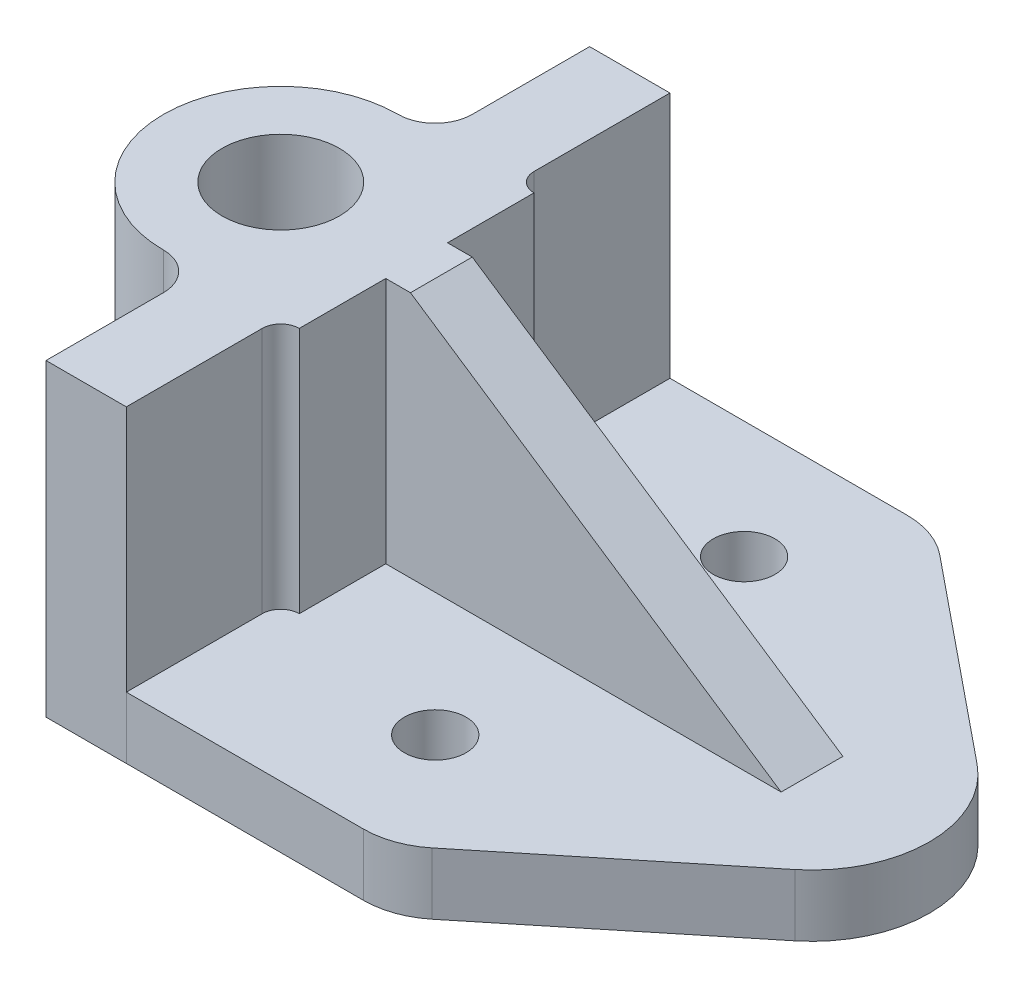
ISO-10303-21;
HEADER;
FILE_DESCRIPTION(('STEP AP214'),'2;1');
FILE_NAME('part.step','',(''),(''),'','','');
FILE_SCHEMA(('AUTOMOTIVE_DESIGN { 1 0 10303 214 1 1 1 1 }'));
ENDSEC;
DATA;
#1=APPLICATION_CONTEXT('core data for automotive mechanical design processes');
#2=APPLICATION_PROTOCOL_DEFINITION('international standard','automotive_design',2000,#1);
#3=PRODUCT_CONTEXT('',#1,'mechanical');
#4=PRODUCT('Part','Part','',(#3));
#5=PRODUCT_RELATED_PRODUCT_CATEGORY('part','',(#4));
#6=PRODUCT_DEFINITION_FORMATION('','',#4);
#7=PRODUCT_DEFINITION_CONTEXT('part definition',#1,'design');
#8=PRODUCT_DEFINITION('design','',#6,#7);
#9=PRODUCT_DEFINITION_SHAPE('','',#8);
#10=(LENGTH_UNIT() NAMED_UNIT(*) SI_UNIT(.MILLI.,.METRE.));
#11=(NAMED_UNIT(*) PLANE_ANGLE_UNIT() SI_UNIT($,.RADIAN.));
#12=(NAMED_UNIT(*) SI_UNIT($,.STERADIAN.) SOLID_ANGLE_UNIT());
#13=UNCERTAINTY_MEASURE_WITH_UNIT(LENGTH_MEASURE(1.E-05),#10,'distance_accuracy_value','');
#14=(GEOMETRIC_REPRESENTATION_CONTEXT(3) GLOBAL_UNCERTAINTY_ASSIGNED_CONTEXT((#13)) GLOBAL_UNIT_ASSIGNED_CONTEXT((#10,
#11,#12)) REPRESENTATION_CONTEXT('',''));
#15=CARTESIAN_POINT('',(0.,0.,0.));
#16=DIRECTION('',(0.,0.,1.));
#17=DIRECTION('',(1.,0.,0.));
#18=AXIS2_PLACEMENT_3D('',#15,#16,#17);
#19=CARTESIAN_POINT('',(0.,10.,0.));
#20=DIRECTION('',(0.,1.,0.));
#21=DIRECTION('',(0.,0.,1.));
#22=AXIS2_PLACEMENT_3D('',#19,#20,#21);
#23=PLANE('',#22);
#24=CARTESIAN_POINT('',(-9.19003696915669,10.,18.1944823733596));
#25=DIRECTION('',(0.,1.,0.));
#26=DIRECTION('',(0.,0.,1.));
#27=AXIS2_PLACEMENT_3D('',#24,#25,#26);
#28=CIRCLE('',#27,5.);
#29=CARTESIAN_POINT('',(-9.19003696915669,10.,23.1944823733596));
#30=VERTEX_POINT('',#29);
#31=EDGE_CURVE('E384',#30,#30,#28,.T.);
#32=ORIENTED_EDGE('',*,*,#31,.F.);
#33=EDGE_LOOP('',(#32));
#34=FACE_BOUND('',#33,.T.);
#35=CARTESIAN_POINT('',(-9.19003696915669,10.,-31.8055176266404));
#36=DIRECTION('',(0.,1.,0.));
#37=DIRECTION('',(0.,0.,-1.));
#38=AXIS2_PLACEMENT_3D('',#35,#36,#37);
#39=CIRCLE('',#38,5.);
#40=CARTESIAN_POINT('',(-9.19003696915669,10.,-36.8055176266405));
#41=VERTEX_POINT('',#40);
#42=EDGE_CURVE('E378',#41,#41,#39,.T.);
#43=ORIENTED_EDGE('',*,*,#42,.F.);
#44=EDGE_LOOP('',(#43));
#45=FACE_BOUND('',#44,.T.);
#46=DIRECTION('',(0.775816310170432,0.,0.630958836116538));
#47=VECTOR('',#46,1.);
#48=CARTESIAN_POINT('',(25.9883869742139,10.,-31.9548809455012));
#49=LINE('',#48,#47);
#50=CARTESIAN_POINT('',(6.39344516969075,10.,-47.8911296588561));
#51=VERTEX_POINT('',#50);
#52=CARTESIAN_POINT('',(38.7937423474742,10.,-21.5404928790838));
#53=VERTEX_POINT('',#52);
#54=EDGE_CURVE('E232',#51,#53,#49,.T.);
#55=ORIENTED_EDGE('',*,*,#54,.F.);
#56=CARTESIAN_POINT('',(-1.80901969982424,10.,-37.8055176266404));
#57=DIRECTION('',(0.,1.,0.));
#58=DIRECTION('',(0.,0.,1.));
#59=AXIS2_PLACEMENT_3D('',#56,#57,#58);
#60=CIRCLE('',#59,13.);
#61=CARTESIAN_POINT('',(-1.80901969982424,10.,-50.8055176266404));
#62=VERTEX_POINT('',#61);
#63=EDGE_CURVE('E63',#51,#62,#60,.T.);
#64=ORIENTED_EDGE('',*,*,#63,.T.);
#65=DIRECTION('',(-1.,0.,0.));
#66=VECTOR('',#65,1.);
#67=CARTESIAN_POINT('',(-53.1900369691567,10.,-50.8055176266404));
#68=LINE('',#67,#66);
#69=CARTESIAN_POINT('',(-53.1900369691567,10.,-50.8055176266404));
#70=VERTEX_POINT('',#69);
#71=EDGE_CURVE('E390',#62,#70,#68,.T.);
#72=ORIENTED_EDGE('',*,*,#71,.T.);
#73=DIRECTION('',(0.,0.,1.));
#74=VECTOR('',#73,1.);
#75=CARTESIAN_POINT('',(-53.1900369691567,10.,-50.8055176266404));
#76=LINE('',#75,#74);
#77=CARTESIAN_POINT('',(-53.1900369691567,10.,-50.7963341859875));
#78=VERTEX_POINT('',#77);
#79=EDGE_CURVE('E394',#70,#78,#76,.T.);
#80=ORIENTED_EDGE('',*,*,#79,.T.);
#81=DIRECTION('',(1.,0.,0.));
#82=VECTOR('',#81,1.);
#83=CARTESIAN_POINT('',(0.,10.,-50.7963341859875));
#84=LINE('',#83,#82);
#85=CARTESIAN_POINT('',(-40.1900369691567,10.,-50.7963341859875));
#86=VERTEX_POINT('',#85);
#87=EDGE_CURVE('E363',#78,#86,#84,.T.);
#88=ORIENTED_EDGE('',*,*,#87,.T.);
#89=DIRECTION('',(0.,0.,1.));
#90=VECTOR('',#89,1.);
#91=CARTESIAN_POINT('',(-40.1900369691567,10.,0.));
#92=LINE('',#91,#90);
#93=CARTESIAN_POINT('',(-40.1900369691567,10.,-28.7963341859874));
#94=VERTEX_POINT('',#93);
#95=EDGE_CURVE('E375',#86,#94,#92,.T.);
#96=ORIENTED_EDGE('',*,*,#95,.T.);
#97=CARTESIAN_POINT('',(-37.1900369691567,10.,-28.7963341859874));
#98=DIRECTION('',(0.,1.,0.));
#99=DIRECTION('',(0.,0.,1.));
#100=AXIS2_PLACEMENT_3D('',#97,#98,#99);
#101=CIRCLE('',#100,3.);
#102=CARTESIAN_POINT('',(-37.1900369691567,10.,-25.7963341859875));
#103=VERTEX_POINT('',#102);
#104=EDGE_CURVE('E372',#94,#103,#101,.T.);
#105=ORIENTED_EDGE('',*,*,#104,.T.);
#106=DIRECTION('',(0.,0.,1.));
#107=VECTOR('',#106,1.);
#108=CARTESIAN_POINT('',(-37.1900369691567,10.,0.));
#109=LINE('',#108,#107);
#110=CARTESIAN_POINT('',(-37.1900369691567,10.,-11.7963341859875));
#111=VERTEX_POINT('',#110);
#112=EDGE_CURVE('E370',#103,#111,#109,.T.);
#113=ORIENTED_EDGE('',*,*,#112,.T.);
#114=DIRECTION('',(1.,0.,0.));
#115=VECTOR('',#114,1.);
#116=CARTESIAN_POINT('',(0.,10.,-11.7963341859875));
#117=LINE('',#116,#115);
#118=CARTESIAN_POINT('',(26.8099630308433,10.,-11.7963341859875));
#119=VERTEX_POINT('',#118);
#120=EDGE_CURVE('E373',#111,#119,#117,.T.);
#121=ORIENTED_EDGE('',*,*,#120,.T.);
#122=DIRECTION('',(0.,0.,1.));
#123=VECTOR('',#122,1.);
#124=CARTESIAN_POINT('',(26.8099630308433,10.,-11.7963341859875));
#125=LINE('',#124,#123);
#126=CARTESIAN_POINT('',(26.8099630308433,10.,-1.79633418598746));
#127=VERTEX_POINT('',#126);
#128=EDGE_CURVE('E250',#119,#127,#125,.T.);
#129=ORIENTED_EDGE('',*,*,#128,.T.);
#130=DIRECTION('',(-1.,0.,0.));
#131=VECTOR('',#130,1.);
#132=CARTESIAN_POINT('',(0.,10.,-1.79633418598746));
#133=LINE('',#132,#131);
#134=CARTESIAN_POINT('',(-37.1900369691567,10.,-1.79633418598746));
#135=VERTEX_POINT('',#134);
#136=EDGE_CURVE('E369',#127,#135,#133,.T.);
#137=ORIENTED_EDGE('',*,*,#136,.T.);
#138=DIRECTION('',(0.,0.,1.));
#139=VECTOR('',#138,1.);
#140=CARTESIAN_POINT('',(-37.1900369691567,10.,0.));
#141=LINE('',#140,#139);
#142=CARTESIAN_POINT('',(-37.1900369691567,10.,12.2036658140125));
#143=VERTEX_POINT('',#142);
#144=EDGE_CURVE('E367',#135,#143,#141,.T.);
#145=ORIENTED_EDGE('',*,*,#144,.T.);
#146=CARTESIAN_POINT('',(-37.1900369691567,10.,15.2036658140125));
#147=DIRECTION('',(0.,1.,0.));
#148=DIRECTION('',(0.,0.,1.));
#149=AXIS2_PLACEMENT_3D('',#146,#147,#148);
#150=CIRCLE('',#149,3.);
#151=CARTESIAN_POINT('',(-40.1900369691567,10.,15.2036658140125));
#152=VERTEX_POINT('',#151);
#153=EDGE_CURVE('E365',#143,#152,#150,.T.);
#154=ORIENTED_EDGE('',*,*,#153,.T.);
#155=DIRECTION('',(0.,0.,1.));
#156=VECTOR('',#155,1.);
#157=CARTESIAN_POINT('',(-40.1900369691567,10.,0.));
#158=LINE('',#157,#156);
#159=CARTESIAN_POINT('',(-40.1900369691567,10.,37.1944823733596));
#160=VERTEX_POINT('',#159);
#161=EDGE_CURVE('E358',#152,#160,#158,.T.);
#162=ORIENTED_EDGE('',*,*,#161,.T.);
#163=DIRECTION('',(1.,0.,0.));
#164=VECTOR('',#163,1.);
#165=CARTESIAN_POINT('',(-53.1900369691567,10.,37.1944823733596));
#166=LINE('',#165,#164);
#167=CARTESIAN_POINT('',(-1.80679394493806,10.,37.1944823733596));
#168=VERTEX_POINT('',#167);
#169=EDGE_CURVE('E396',#160,#168,#166,.T.);
#170=ORIENTED_EDGE('',*,*,#169,.T.);
#171=CARTESIAN_POINT('',(-1.80679394493806,10.,24.1944823733596));
#172=DIRECTION('',(0.,1.,0.));
#173=DIRECTION('',(0.,0.,1.));
#174=AXIS2_PLACEMENT_3D('',#171,#172,#173);
#175=CIRCLE('',#174,13.);
#176=CARTESIAN_POINT('',(6.39260394118663,10.,34.2825879589001));
#177=VERTEX_POINT('',#176);
#178=EDGE_CURVE('E528',#168,#177,#175,.T.);
#179=ORIENTED_EDGE('',*,*,#178,.T.);
#180=DIRECTION('',(0.776008121964656,0.,-0.630722914317284));
#181=VECTOR('',#180,1.);
#182=CARTESIAN_POINT('',(19.3225298082994,10.,23.7734189257656));
#183=LINE('',#182,#181);
#184=CARTESIAN_POINT('',(38.7937423474742,10.,7.94763106299511));
#185=VERTEX_POINT('',#184);
#186=EDGE_CURVE('E222',#177,#185,#183,.T.);
#187=ORIENTED_EDGE('',*,*,#186,.T.);
#188=CARTESIAN_POINT('',(26.8100820325476,10.,-6.79643090804433));
#189=DIRECTION('',(0.,1.,0.));
#190=DIRECTION('',(0.,0.,1.));
#191=AXIS2_PLACEMENT_3D('',#188,#189,#190);
#192=CIRCLE('',#191,18.9998809982957);
#193=EDGE_CURVE('E237',#185,#53,#192,.T.);
#194=ORIENTED_EDGE('',*,*,#193,.T.);
#195=EDGE_LOOP('',(#55,#64,#72,#80,#88,#96,#105,#113,#121,#129,#137,#145,#154,#162,#170,#179,
#187,#194));
#196=FACE_BOUND('',#195,.T.);
#197=ADVANCED_FACE('F41',(#34,#45,#196),#23,.T.);
#198=CARTESIAN_POINT('',(0.,0.,0.));
#199=DIRECTION('',(0.,1.,0.));
#200=DIRECTION('',(0.,0.,1.));
#201=AXIS2_PLACEMENT_3D('',#198,#199,#200);
#202=PLANE('',#201);
#203=CARTESIAN_POINT('',(-9.19003696915669,0.,18.1944823733596));
#204=DIRECTION('',(0.,1.,0.));
#205=DIRECTION('',(0.,0.,1.));
#206=AXIS2_PLACEMENT_3D('',#203,#204,#205);
#207=CIRCLE('',#206,5.);
#208=CARTESIAN_POINT('',(-9.19003696915669,0.,23.1944823733596));
#209=VERTEX_POINT('',#208);
#210=EDGE_CURVE('E381',#209,#209,#207,.T.);
#211=ORIENTED_EDGE('',*,*,#210,.T.);
#212=EDGE_LOOP('',(#211));
#213=FACE_BOUND('',#212,.T.);
#214=CARTESIAN_POINT('',(-9.19003696915669,0.,-31.8055176266404));
#215=DIRECTION('',(0.,1.,0.));
#216=DIRECTION('',(0.,0.,-1.));
#217=AXIS2_PLACEMENT_3D('',#214,#215,#216);
#218=CIRCLE('',#217,5.);
#219=CARTESIAN_POINT('',(-9.19003696915669,0.,-36.8055176266405));
#220=VERTEX_POINT('',#219);
#221=EDGE_CURVE('E377',#220,#220,#218,.T.);
#222=ORIENTED_EDGE('',*,*,#221,.T.);
#223=EDGE_LOOP('',(#222));
#224=FACE_BOUND('',#223,.T.);
#225=DIRECTION('',(0.,0.,1.));
#226=VECTOR('',#225,1.);
#227=CARTESIAN_POINT('',(-53.1900369691567,0.,-50.8055176266404));
#228=LINE('',#227,#226);
#229=CARTESIAN_POINT('',(-53.1900369691567,0.,-14.1617941173156));
#230=VERTEX_POINT('',#229);
#231=CARTESIAN_POINT('',(-53.1900369691567,0.,0.569125745340668));
#232=VERTEX_POINT('',#231);
#233=EDGE_CURVE('E413',#230,#232,#228,.T.);
#234=ORIENTED_EDGE('',*,*,#233,.F.);
#235=CARTESIAN_POINT('',(-59.1900369691567,0.,-6.79633418598746));
#236=DIRECTION('',(0.,1.,0.));
#237=DIRECTION('',(0.,0.,1.));
#238=AXIS2_PLACEMENT_3D('',#235,#236,#237);
#239=CIRCLE('',#238,9.5);
#240=EDGE_CURVE('E271',#230,#232,#239,.T.);
#241=ORIENTED_EDGE('',*,*,#240,.T.);
#242=EDGE_LOOP('',(#234,#241));
#243=FACE_BOUND('',#242,.T.);
#244=DIRECTION('',(-1.,0.,0.));
#245=VECTOR('',#244,1.);
#246=CARTESIAN_POINT('',(-53.1900369691567,0.,-50.8055176266404));
#247=LINE('',#246,#245);
#248=CARTESIAN_POINT('',(-1.80901969982424,0.,-50.8055176266404));
#249=VERTEX_POINT('',#248);
#250=CARTESIAN_POINT('',(-53.1900369691567,0.,-50.8055176266404));
#251=VERTEX_POINT('',#250);
#252=EDGE_CURVE('E387',#249,#251,#247,.T.);
#253=ORIENTED_EDGE('',*,*,#252,.F.);
#254=CARTESIAN_POINT('',(-1.80901969982424,0.,-37.8055176266404));
#255=DIRECTION('',(0.,1.,0.));
#256=DIRECTION('',(0.,0.,1.));
#257=AXIS2_PLACEMENT_3D('',#254,#255,#256);
#258=CIRCLE('',#257,13.);
#259=CARTESIAN_POINT('',(6.39344516969075,0.,-47.8911296588561));
#260=VERTEX_POINT('',#259);
#261=EDGE_CURVE('E12',#249,#260,#258,.F.);
#262=ORIENTED_EDGE('',*,*,#261,.T.);
#263=DIRECTION('',(0.775816310170432,0.,0.630958836116538));
#264=VECTOR('',#263,1.);
#265=CARTESIAN_POINT('',(25.9883869742139,0.,-31.9548809455012));
#266=LINE('',#265,#264);
#267=CARTESIAN_POINT('',(38.7937423474742,0.,-21.5404928790838));
#268=VERTEX_POINT('',#267);
#269=EDGE_CURVE('E228',#260,#268,#266,.T.);
#270=ORIENTED_EDGE('',*,*,#269,.T.);
#271=CARTESIAN_POINT('',(26.8100820325476,0.,-6.79643090804433));
#272=DIRECTION('',(0.,1.,0.));
#273=DIRECTION('',(0.,0.,1.));
#274=AXIS2_PLACEMENT_3D('',#271,#272,#273);
#275=CIRCLE('',#274,18.9998809982957);
#276=CARTESIAN_POINT('',(38.7937423474742,0.,7.94763106299511));
#277=VERTEX_POINT('',#276);
#278=EDGE_CURVE('E225',#277,#268,#275,.T.);
#279=ORIENTED_EDGE('',*,*,#278,.F.);
#280=DIRECTION('',(0.776008121964656,0.,-0.630722914317284));
#281=VECTOR('',#280,1.);
#282=CARTESIAN_POINT('',(19.3225298082994,0.,23.7734189257656));
#283=LINE('',#282,#281);
#284=CARTESIAN_POINT('',(6.39260394118663,0.,34.2825879589001));
#285=VERTEX_POINT('',#284);
#286=EDGE_CURVE('E212',#285,#277,#283,.T.);
#287=ORIENTED_EDGE('',*,*,#286,.F.);
#288=CARTESIAN_POINT('',(-1.80679394493806,0.,24.1944823733596));
#289=DIRECTION('',(0.,1.,0.));
#290=DIRECTION('',(0.,0.,1.));
#291=AXIS2_PLACEMENT_3D('',#288,#289,#290);
#292=CIRCLE('',#291,13.);
#293=CARTESIAN_POINT('',(-1.80679394493806,0.,37.1944823733596));
#294=VERTEX_POINT('',#293);
#295=EDGE_CURVE('E543',#285,#294,#292,.F.);
#296=ORIENTED_EDGE('',*,*,#295,.T.);
#297=DIRECTION('',(1.,0.,0.));
#298=VECTOR('',#297,1.);
#299=CARTESIAN_POINT('',(-53.1900369691567,0.,37.1944823733596));
#300=LINE('',#299,#298);
#301=CARTESIAN_POINT('',(-40.1900369691567,0.,37.1944823733596));
#302=VERTEX_POINT('',#301);
#303=EDGE_CURVE('E393',#302,#294,#300,.T.);
#304=ORIENTED_EDGE('',*,*,#303,.F.);
#305=DIRECTION('',(0.,0.,-1.));
#306=VECTOR('',#305,1.);
#307=CARTESIAN_POINT('',(-40.1900369691567,0.,37.2036658140125));
#308=LINE('',#307,#306);
#309=CARTESIAN_POINT('',(-40.1900369691567,0.,37.2036658140125));
#310=VERTEX_POINT('',#309);
#311=EDGE_CURVE('E434',#310,#302,#308,.T.);
#312=ORIENTED_EDGE('',*,*,#311,.F.);
#313=DIRECTION('',(1.,0.,0.));
#314=VECTOR('',#313,1.);
#315=CARTESIAN_POINT('',(-53.1900369691567,0.,37.2036658140125));
#316=LINE('',#315,#314);
#317=CARTESIAN_POINT('',(-53.1900369691567,0.,37.2036658140125));
#318=VERTEX_POINT('',#317);
#319=EDGE_CURVE('E429',#318,#310,#316,.T.);
#320=ORIENTED_EDGE('',*,*,#319,.F.);
#321=CARTESIAN_POINT('',(-53.1900369691567,0.,18.2036658140125));
#322=VERTEX_POINT('',#321);
#323=EDGE_CURVE('E401',#322,#318,#228,.T.);
#324=ORIENTED_EDGE('',*,*,#323,.F.);
#325=CARTESIAN_POINT('',(-59.1900369691567,0.,18.2036658140125));
#326=DIRECTION('',(0.,-1.,0.));
#327=DIRECTION('',(0.,0.,1.));
#328=AXIS2_PLACEMENT_3D('',#325,#326,#327);
#329=CIRCLE('',#328,6.);
#330=CARTESIAN_POINT('',(-59.1900369691567,0.,12.2036658140125));
#331=VERTEX_POINT('',#330);
#332=EDGE_CURVE('E345',#331,#322,#329,.T.);
#333=ORIENTED_EDGE('',*,*,#332,.F.);
#334=CARTESIAN_POINT('',(-59.1900369691567,0.,-6.79633418598746));
#335=DIRECTION('',(0.,1.,0.));
#336=DIRECTION('',(0.,0.,1.));
#337=AXIS2_PLACEMENT_3D('',#334,#335,#336);
#338=CIRCLE('',#337,19.);
#339=CARTESIAN_POINT('',(-59.1900369691567,0.,-25.7963341859874));
#340=VERTEX_POINT('',#339);
#341=EDGE_CURVE('E354',#340,#331,#338,.T.);
#342=ORIENTED_EDGE('',*,*,#341,.F.);
#343=CARTESIAN_POINT('',(-59.1900369691567,0.,-31.7963341859875));
#344=DIRECTION('',(0.,-1.,0.));
#345=DIRECTION('',(0.,0.,-1.));
#346=AXIS2_PLACEMENT_3D('',#343,#344,#345);
#347=CIRCLE('',#346,6.);
#348=CARTESIAN_POINT('',(-53.1900369691567,0.,-31.7963341859875));
#349=VERTEX_POINT('',#348);
#350=EDGE_CURVE('E487',#349,#340,#347,.T.);
#351=ORIENTED_EDGE('',*,*,#350,.F.);
#352=EDGE_CURVE('E411',#251,#349,#228,.T.);
#353=ORIENTED_EDGE('',*,*,#352,.F.);
#354=EDGE_LOOP('',(#253,#262,#270,#279,#287,#296,#304,#312,#320,#324,#333,#342,#351,#353));
#355=FACE_BOUND('',#354,.T.);
#356=ADVANCED_FACE('F226',(#213,#224,#243,#355),#202,.F.);
#357=CARTESIAN_POINT('',(-53.1900369691567,10.,37.1944823733596));
#358=DIRECTION('',(0.,0.,-1.));
#359=DIRECTION('',(-1.,0.,0.));
#360=AXIS2_PLACEMENT_3D('',#357,#358,#359);
#361=PLANE('',#360);
#362=ORIENTED_EDGE('',*,*,#303,.T.);
#363=DIRECTION('',(0.,1.,0.));
#364=VECTOR('',#363,1.);
#365=CARTESIAN_POINT('',(-1.80679394493806,10.,37.1944823733596));
#366=LINE('',#365,#364);
#367=EDGE_CURVE('E524',#294,#168,#366,.T.);
#368=ORIENTED_EDGE('',*,*,#367,.T.);
#369=ORIENTED_EDGE('',*,*,#169,.F.);
#370=DIRECTION('',(0.,1.,0.));
#371=VECTOR('',#370,1.);
#372=CARTESIAN_POINT('',(-40.1900369691567,10.,37.1944823733596));
#373=LINE('',#372,#371);
#374=EDGE_CURVE('E414',#302,#160,#373,.T.);
#375=ORIENTED_EDGE('',*,*,#374,.F.);
#376=EDGE_LOOP('',(#362,#368,#369,#375));
#377=FACE_BOUND('',#376,.T.);
#378=ADVANCED_FACE('F558',(#377),#361,.F.);
#379=CARTESIAN_POINT('',(-59.1900369691567,10.,-6.79633418598746));
#380=DIRECTION('',(0.,1.,0.));
#381=DIRECTION('',(0.,0.,1.));
#382=AXIS2_PLACEMENT_3D('',#379,#380,#381);
#383=CIRCLE('',#382,9.5);
#384=CARTESIAN_POINT('',(-53.1900369691567,10.,-14.1617941173156));
#385=VERTEX_POINT('',#384);
#386=CARTESIAN_POINT('',(-53.1900369691567,10.,0.569125745340668));
#387=VERTEX_POINT('',#386);
#388=EDGE_CURVE('E360',#385,#387,#383,.F.);
#389=ORIENTED_EDGE('',*,*,#388,.F.);
#390=EDGE_CURVE('E392',#385,#387,#76,.T.);
#391=ORIENTED_EDGE('',*,*,#390,.T.);
#392=EDGE_LOOP('',(#389,#391));
#393=FACE_BOUND('',#392,.T.);
#394=ADVANCED_FACE('F571',(#393),#23,.T.);
#395=CARTESIAN_POINT('',(-53.1900369691567,10.,-50.8055176266404));
#396=DIRECTION('',(1.,0.,0.));
#397=DIRECTION('',(0.,0.,-1.));
#398=AXIS2_PLACEMENT_3D('',#395,#396,#397);
#399=PLANE('',#398);
#400=ORIENTED_EDGE('',*,*,#352,.T.);
#401=DIRECTION('',(0.,-1.,0.));
#402=VECTOR('',#401,1.);
#403=CARTESIAN_POINT('',(-53.1900369691567,10.,-31.7963341859875));
#404=LINE('',#403,#402);
#405=CARTESIAN_POINT('',(-53.1900369691567,50.,-31.7963341859875));
#406=VERTEX_POINT('',#405);
#407=EDGE_CURVE('E522',#406,#349,#404,.T.);
#408=ORIENTED_EDGE('',*,*,#407,.F.);
#409=DIRECTION('',(0.,0.,1.));
#410=VECTOR('',#409,1.);
#411=CARTESIAN_POINT('',(-53.1900369691567,50.,-31.7963341859875));
#412=LINE('',#411,#410);
#413=CARTESIAN_POINT('',(-53.1900369691567,50.,-50.7963341859875));
#414=VERTEX_POINT('',#413);
#415=EDGE_CURVE('E327',#414,#406,#412,.T.);
#416=ORIENTED_EDGE('',*,*,#415,.F.);
#417=DIRECTION('',(0.,-1.,0.));
#418=VECTOR('',#417,1.);
#419=CARTESIAN_POINT('',(-53.1900369691567,10.,-50.7963341859875));
#420=LINE('',#419,#418);
#421=EDGE_CURVE('E482',#414,#78,#420,.T.);
#422=ORIENTED_EDGE('',*,*,#421,.T.);
#423=ORIENTED_EDGE('',*,*,#79,.F.);
#424=DIRECTION('',(0.,-1.,0.));
#425=VECTOR('',#424,1.);
#426=CARTESIAN_POINT('',(-53.1900369691567,10.,-50.8055176266404));
#427=LINE('',#426,#425);
#428=EDGE_CURVE('E399',#70,#251,#427,.T.);
#429=ORIENTED_EDGE('',*,*,#428,.T.);
#430=EDGE_LOOP('',(#400,#408,#416,#422,#423,#429));
#431=FACE_BOUND('',#430,.T.);
#432=ADVANCED_FACE('F520',(#431),#399,.F.);
#433=DIRECTION('',(0.,0.,1.));
#434=VECTOR('',#433,1.);
#435=CARTESIAN_POINT('',(-53.1900369691567,50.,18.2036658140125));
#436=LINE('',#435,#434);
#437=CARTESIAN_POINT('',(-53.1900369691567,50.,18.2036658140125));
#438=VERTEX_POINT('',#437);
#439=CARTESIAN_POINT('',(-53.1900369691567,50.,37.2036658140125));
#440=VERTEX_POINT('',#439);
#441=EDGE_CURVE('E268',#438,#440,#436,.T.);
#442=ORIENTED_EDGE('',*,*,#441,.F.);
#443=DIRECTION('',(0.,-1.,0.));
#444=VECTOR('',#443,1.);
#445=CARTESIAN_POINT('',(-53.1900369691567,10.,18.2036658140125));
#446=LINE('',#445,#444);
#447=EDGE_CURVE('E351',#438,#322,#446,.T.);
#448=ORIENTED_EDGE('',*,*,#447,.T.);
#449=ORIENTED_EDGE('',*,*,#323,.T.);
#450=DIRECTION('',(0.,-1.,0.));
#451=VECTOR('',#450,1.);
#452=CARTESIAN_POINT('',(-53.1900369691567,10.,37.2036658140125));
#453=LINE('',#452,#451);
#454=EDGE_CURVE('E348',#440,#318,#453,.T.);
#455=ORIENTED_EDGE('',*,*,#454,.F.);
#456=EDGE_LOOP('',(#442,#448,#449,#455));
#457=FACE_BOUND('',#456,.T.);
#458=ADVANCED_FACE('F422',(#457),#399,.F.);
#459=CARTESIAN_POINT('',(-53.1900369691567,10.,-50.8055176266404));
#460=DIRECTION('',(0.,0.,1.));
#461=DIRECTION('',(1.,0.,0.));
#462=AXIS2_PLACEMENT_3D('',#459,#460,#461);
#463=PLANE('',#462);
#464=ORIENTED_EDGE('',*,*,#71,.F.);
#465=DIRECTION('',(0.,1.,0.));
#466=VECTOR('',#465,1.);
#467=CARTESIAN_POINT('',(-1.80901969982424,10.,-50.8055176266404));
#468=LINE('',#467,#466);
#469=EDGE_CURVE('E49',#62,#249,#468,.F.);
#470=ORIENTED_EDGE('',*,*,#469,.T.);
#471=ORIENTED_EDGE('',*,*,#252,.T.);
#472=ORIENTED_EDGE('',*,*,#428,.F.);
#473=EDGE_LOOP('',(#464,#470,#471,#472));
#474=FACE_BOUND('',#473,.T.);
#475=ADVANCED_FACE('F626',(#474),#463,.F.);
#476=ORIENTED_EDGE('',*,*,#233,.T.);
#477=DIRECTION('',(0.,-1.,0.));
#478=VECTOR('',#477,1.);
#479=CARTESIAN_POINT('',(-53.1900369691567,10.,0.56912574534067));
#480=LINE('',#479,#478);
#481=EDGE_CURVE('E525',#232,#387,#480,.F.);
#482=ORIENTED_EDGE('',*,*,#481,.T.);
#483=ORIENTED_EDGE('',*,*,#390,.F.);
#484=DIRECTION('',(0.,-1.,0.));
#485=VECTOR('',#484,1.);
#486=CARTESIAN_POINT('',(-53.1900369691567,10.,-14.1617941173156));
#487=LINE('',#486,#485);
#488=EDGE_CURVE('E530',#385,#230,#487,.T.);
#489=ORIENTED_EDGE('',*,*,#488,.T.);
#490=EDGE_LOOP('',(#476,#482,#483,#489));
#491=FACE_BOUND('',#490,.T.);
#492=ADVANCED_FACE('F587',(#491),#399,.F.);
#493=CARTESIAN_POINT('',(-9.19003696915669,10.,18.1944823733596));
#494=DIRECTION('',(0.,-1.,0.));
#495=DIRECTION('',(0.,0.,-1.));
#496=AXIS2_PLACEMENT_3D('',#493,#494,#495);
#497=CYLINDRICAL_SURFACE('',#496,5.);
#498=ORIENTED_EDGE('',*,*,#31,.T.);
#499=EDGE_LOOP('',(#498));
#500=FACE_BOUND('',#499,.T.);
#501=ORIENTED_EDGE('',*,*,#210,.F.);
#502=EDGE_LOOP('',(#501));
#503=FACE_BOUND('',#502,.T.);
#504=ADVANCED_FACE('F605',(#500,#503),#497,.F.);
#505=CARTESIAN_POINT('',(-9.19003696915669,10.,-31.8055176266404));
#506=DIRECTION('',(0.,-1.,0.));
#507=DIRECTION('',(0.,0.,-1.));
#508=AXIS2_PLACEMENT_3D('',#505,#506,#507);
#509=CYLINDRICAL_SURFACE('',#508,5.);
#510=ORIENTED_EDGE('',*,*,#42,.T.);
#511=EDGE_LOOP('',(#510));
#512=FACE_BOUND('',#511,.T.);
#513=ORIENTED_EDGE('',*,*,#221,.F.);
#514=EDGE_LOOP('',(#513));
#515=FACE_BOUND('',#514,.T.);
#516=ADVANCED_FACE('F597',(#512,#515),#509,.F.);
#517=CARTESIAN_POINT('',(-59.1900369691567,10.,-6.79633418598746));
#518=DIRECTION('',(0.,-1.,0.));
#519=DIRECTION('',(0.,0.,-1.));
#520=AXIS2_PLACEMENT_3D('',#517,#518,#519);
#521=CYLINDRICAL_SURFACE('',#520,9.5);
#522=CARTESIAN_POINT('',(-59.1900369691567,50.,-6.79633418598746));
#523=DIRECTION('',(0.,1.,0.));
#524=DIRECTION('',(0.,0.,1.));
#525=AXIS2_PLACEMENT_3D('',#522,#523,#524);
#526=CIRCLE('',#525,9.5);
#527=CARTESIAN_POINT('',(-59.1900369691567,50.,2.70366581401254));
#528=VERTEX_POINT('',#527);
#529=EDGE_CURVE('E249',#528,#528,#526,.T.);
#530=ORIENTED_EDGE('',*,*,#529,.T.);
#531=EDGE_LOOP('',(#530));
#532=FACE_BOUND('',#531,.T.);
#533=ORIENTED_EDGE('',*,*,#481,.F.);
#534=ORIENTED_EDGE('',*,*,#240,.F.);
#535=ORIENTED_EDGE('',*,*,#488,.F.);
#536=ORIENTED_EDGE('',*,*,#388,.T.);
#537=EDGE_LOOP('',(#533,#534,#535,#536));
#538=FACE_BOUND('',#537,.T.);
#539=ADVANCED_FACE('F594',(#532,#538),#521,.F.);
#540=CARTESIAN_POINT('',(-59.1900369691567,10.,18.2036658140125));
#541=DIRECTION('',(0.,-1.,0.));
#542=DIRECTION('',(0.,0.,-1.));
#543=AXIS2_PLACEMENT_3D('',#540,#541,#542);
#544=CYLINDRICAL_SURFACE('',#543,6.);
#545=ORIENTED_EDGE('',*,*,#332,.T.);
#546=ORIENTED_EDGE('',*,*,#447,.F.);
#547=CARTESIAN_POINT('',(-59.1900369691567,50.,18.2036658140125));
#548=DIRECTION('',(0.,-1.,0.));
#549=DIRECTION('',(0.,0.,1.));
#550=AXIS2_PLACEMENT_3D('',#547,#548,#549);
#551=CIRCLE('',#550,6.);
#552=CARTESIAN_POINT('',(-59.1900369691567,50.,12.2036658140125));
#553=VERTEX_POINT('',#552);
#554=EDGE_CURVE('E262',#553,#438,#551,.T.);
#555=ORIENTED_EDGE('',*,*,#554,.F.);
#556=DIRECTION('',(0.,-1.,0.));
#557=VECTOR('',#556,1.);
#558=CARTESIAN_POINT('',(-59.1900369691567,10.,12.2036658140125));
#559=LINE('',#558,#557);
#560=EDGE_CURVE('E355',#553,#331,#559,.T.);
#561=ORIENTED_EDGE('',*,*,#560,.T.);
#562=EDGE_LOOP('',(#545,#546,#555,#561));
#563=FACE_BOUND('',#562,.T.);
#564=ADVANCED_FACE('F504',(#563),#544,.F.);
#565=CARTESIAN_POINT('',(-59.1900369691567,10.,-6.79633418598746));
#566=DIRECTION('',(0.,-1.,0.));
#567=DIRECTION('',(0.,0.,-1.));
#568=AXIS2_PLACEMENT_3D('',#565,#566,#567);
#569=CYLINDRICAL_SURFACE('',#568,19.);
#570=ORIENTED_EDGE('',*,*,#341,.T.);
#571=ORIENTED_EDGE('',*,*,#560,.F.);
#572=CARTESIAN_POINT('',(-59.1900369691567,50.,-6.79633418598746));
#573=DIRECTION('',(0.,1.,0.));
#574=DIRECTION('',(0.,0.,1.));
#575=AXIS2_PLACEMENT_3D('',#572,#573,#574);
#576=CIRCLE('',#575,19.);
#577=CARTESIAN_POINT('',(-59.1900369691567,50.,-25.7963341859874));
#578=VERTEX_POINT('',#577);
#579=EDGE_CURVE('E265',#578,#553,#576,.T.);
#580=ORIENTED_EDGE('',*,*,#579,.F.);
#581=DIRECTION('',(0.,-1.,0.));
#582=VECTOR('',#581,1.);
#583=CARTESIAN_POINT('',(-59.1900369691567,10.,-25.7963341859874));
#584=LINE('',#583,#582);
#585=EDGE_CURVE('E491',#578,#340,#584,.T.);
#586=ORIENTED_EDGE('',*,*,#585,.T.);
#587=EDGE_LOOP('',(#570,#571,#580,#586));
#588=FACE_BOUND('',#587,.T.);
#589=ADVANCED_FACE('F509',(#588),#569,.T.);
#590=CARTESIAN_POINT('',(-59.1900369691567,10.,-31.7963341859875));
#591=DIRECTION('',(0.,-1.,0.));
#592=DIRECTION('',(0.,0.,-1.));
#593=AXIS2_PLACEMENT_3D('',#590,#591,#592);
#594=CYLINDRICAL_SURFACE('',#593,6.);
#595=ORIENTED_EDGE('',*,*,#350,.T.);
#596=ORIENTED_EDGE('',*,*,#585,.F.);
#597=CARTESIAN_POINT('',(-59.1900369691567,50.,-31.7963341859875));
#598=DIRECTION('',(0.,-1.,0.));
#599=DIRECTION('',(0.,0.,-1.));
#600=AXIS2_PLACEMENT_3D('',#597,#598,#599);
#601=CIRCLE('',#600,6.);
#602=EDGE_CURVE('E332',#406,#578,#601,.T.);
#603=ORIENTED_EDGE('',*,*,#602,.F.);
#604=ORIENTED_EDGE('',*,*,#407,.T.);
#605=EDGE_LOOP('',(#595,#596,#603,#604));
#606=FACE_BOUND('',#605,.T.);
#607=ADVANCED_FACE('F513',(#606),#594,.F.);
#608=CARTESIAN_POINT('',(-53.1900369691567,10.,-50.7963341859875));
#609=DIRECTION('',(0.,0.,1.));
#610=DIRECTION('',(1.,0.,0.));
#611=AXIS2_PLACEMENT_3D('',#608,#609,#610);
#612=PLANE('',#611);
#613=ORIENTED_EDGE('',*,*,#87,.F.);
#614=ORIENTED_EDGE('',*,*,#421,.F.);
#615=DIRECTION('',(-1.,0.,0.));
#616=VECTOR('',#615,1.);
#617=CARTESIAN_POINT('',(-53.1900369691567,50.,-50.7963341859875));
#618=LINE('',#617,#616);
#619=CARTESIAN_POINT('',(-40.1900369691567,50.,-50.7963341859875));
#620=VERTEX_POINT('',#619);
#621=EDGE_CURVE('E322',#620,#414,#618,.T.);
#622=ORIENTED_EDGE('',*,*,#621,.F.);
#623=DIRECTION('',(0.,-1.,0.));
#624=VECTOR('',#623,1.);
#625=CARTESIAN_POINT('',(-40.1900369691567,10.,-50.7963341859875));
#626=LINE('',#625,#624);
#627=EDGE_CURVE('E477',#620,#86,#626,.T.);
#628=ORIENTED_EDGE('',*,*,#627,.T.);
#629=EDGE_LOOP('',(#613,#614,#622,#628));
#630=FACE_BOUND('',#629,.T.);
#631=ADVANCED_FACE('F788',(#630),#612,.F.);
#632=CARTESIAN_POINT('',(-40.1900369691567,10.,-50.7963341859875));
#633=DIRECTION('',(-1.,0.,0.));
#634=DIRECTION('',(0.,0.,1.));
#635=AXIS2_PLACEMENT_3D('',#632,#633,#634);
#636=PLANE('',#635);
#637=ORIENTED_EDGE('',*,*,#95,.F.);
#638=ORIENTED_EDGE('',*,*,#627,.F.);
#639=DIRECTION('',(0.,0.,-1.));
#640=VECTOR('',#639,1.);
#641=CARTESIAN_POINT('',(-40.1900369691567,50.,-50.7963341859875));
#642=LINE('',#641,#640);
#643=CARTESIAN_POINT('',(-40.1900369691567,50.,-28.7963341859874));
#644=VERTEX_POINT('',#643);
#645=EDGE_CURVE('E317',#644,#620,#642,.T.);
#646=ORIENTED_EDGE('',*,*,#645,.F.);
#647=DIRECTION('',(0.,-1.,0.));
#648=VECTOR('',#647,1.);
#649=CARTESIAN_POINT('',(-40.1900369691567,10.,-28.7963341859874));
#650=LINE('',#649,#648);
#651=EDGE_CURVE('E472',#644,#94,#650,.T.);
#652=ORIENTED_EDGE('',*,*,#651,.T.);
#653=EDGE_LOOP('',(#637,#638,#646,#652));
#654=FACE_BOUND('',#653,.T.);
#655=ADVANCED_FACE('F778',(#654),#636,.F.);
#656=CARTESIAN_POINT('',(-37.1900369691567,10.,-28.7963341859874));
#657=DIRECTION('',(0.,-1.,0.));
#658=DIRECTION('',(0.,0.,-1.));
#659=AXIS2_PLACEMENT_3D('',#656,#657,#658);
#660=CYLINDRICAL_SURFACE('',#659,3.);
#661=ORIENTED_EDGE('',*,*,#104,.F.);
#662=ORIENTED_EDGE('',*,*,#651,.F.);
#663=CARTESIAN_POINT('',(-37.1900369691567,50.,-28.7963341859874));
#664=DIRECTION('',(0.,-1.,0.));
#665=DIRECTION('',(0.,0.,-1.));
#666=AXIS2_PLACEMENT_3D('',#663,#664,#665);
#667=CIRCLE('',#666,3.);
#668=CARTESIAN_POINT('',(-37.1900369691567,50.,-25.7963341859875));
#669=VERTEX_POINT('',#668);
#670=EDGE_CURVE('E312',#669,#644,#667,.T.);
#671=ORIENTED_EDGE('',*,*,#670,.F.);
#672=DIRECTION('',(0.,-1.,0.));
#673=VECTOR('',#672,1.);
#674=CARTESIAN_POINT('',(-37.1900369691567,10.,-25.7963341859875));
#675=LINE('',#674,#673);
#676=EDGE_CURVE('E467',#669,#103,#675,.T.);
#677=ORIENTED_EDGE('',*,*,#676,.T.);
#678=EDGE_LOOP('',(#661,#662,#671,#677));
#679=FACE_BOUND('',#678,.T.);
#680=ADVANCED_FACE('F768',(#679),#660,.F.);
#681=CARTESIAN_POINT('',(-37.1900369691567,10.,-25.7963341859875));
#682=DIRECTION('',(-1.,0.,0.));
#683=DIRECTION('',(0.,0.,1.));
#684=AXIS2_PLACEMENT_3D('',#681,#682,#683);
#685=PLANE('',#684);
#686=ORIENTED_EDGE('',*,*,#112,.F.);
#687=ORIENTED_EDGE('',*,*,#676,.F.);
#688=DIRECTION('',(0.,0.,-1.));
#689=VECTOR('',#688,1.);
#690=CARTESIAN_POINT('',(-37.1900369691567,50.,-25.7963341859875));
#691=LINE('',#690,#689);
#692=CARTESIAN_POINT('',(-37.1900369691567,50.,-11.7963341859875));
#693=VERTEX_POINT('',#692);
#694=EDGE_CURVE('E307',#693,#669,#691,.T.);
#695=ORIENTED_EDGE('',*,*,#694,.F.);
#696=DIRECTION('',(0.,-1.,0.));
#697=VECTOR('',#696,1.);
#698=CARTESIAN_POINT('',(-37.1900369691567,10.,-11.7963341859875));
#699=LINE('',#698,#697);
#700=EDGE_CURVE('E462',#693,#111,#699,.T.);
#701=ORIENTED_EDGE('',*,*,#700,.T.);
#702=EDGE_LOOP('',(#686,#687,#695,#701));
#703=FACE_BOUND('',#702,.T.);
#704=ADVANCED_FACE('F731',(#703),#685,.F.);
#705=CARTESIAN_POINT('',(-37.1900369691567,10.,-11.7963341859875));
#706=DIRECTION('',(0.,0.,1.));
#707=DIRECTION('',(1.,0.,0.));
#708=AXIS2_PLACEMENT_3D('',#705,#706,#707);
#709=PLANE('',#708);
#710=ORIENTED_EDGE('',*,*,#120,.F.);
#711=ORIENTED_EDGE('',*,*,#700,.F.);
#712=DIRECTION('',(-1.,0.,0.));
#713=VECTOR('',#712,1.);
#714=CARTESIAN_POINT('',(-37.1900369691567,50.,-11.7963341859875));
#715=LINE('',#714,#713);
#716=CARTESIAN_POINT('',(-33.1900369691567,50.,-11.7963341859875));
#717=VERTEX_POINT('',#716);
#718=EDGE_CURVE('E302',#717,#693,#715,.T.);
#719=ORIENTED_EDGE('',*,*,#718,.F.);
#720=DIRECTION('',(-0.832050294337844,0.554700196225229,0.));
#721=VECTOR('',#720,1.);
#722=CARTESIAN_POINT('',(26.8099630308433,10.,-11.7963341859875));
#723=LINE('',#722,#721);
#724=EDGE_CURVE('E247',#119,#717,#723,.T.);
#725=ORIENTED_EDGE('',*,*,#724,.F.);
#726=EDGE_LOOP('',(#710,#711,#719,#725));
#727=FACE_BOUND('',#726,.T.);
#728=ADVANCED_FACE('F721',(#727),#709,.F.);
#729=CARTESIAN_POINT('',(-37.1900369691567,10.,-1.79633418598746));
#730=DIRECTION('',(0.,0.,-1.));
#731=DIRECTION('',(-1.,0.,0.));
#732=AXIS2_PLACEMENT_3D('',#729,#730,#731);
#733=PLANE('',#732);
#734=ORIENTED_EDGE('',*,*,#136,.F.);
#735=DIRECTION('',(-0.832050294337844,0.554700196225229,0.));
#736=VECTOR('',#735,1.);
#737=CARTESIAN_POINT('',(26.8099630308433,10.,-1.79633418598746));
#738=LINE('',#737,#736);
#739=CARTESIAN_POINT('',(-33.1900369691567,50.,-1.79633418598746));
#740=VERTEX_POINT('',#739);
#741=EDGE_CURVE('E246',#127,#740,#738,.T.);
#742=ORIENTED_EDGE('',*,*,#741,.T.);
#743=DIRECTION('',(1.,0.,0.));
#744=VECTOR('',#743,1.);
#745=CARTESIAN_POINT('',(-37.1900369691567,50.,-1.79633418598746));
#746=LINE('',#745,#744);
#747=CARTESIAN_POINT('',(-37.1900369691567,50.,-1.79633418598746));
#748=VERTEX_POINT('',#747);
#749=EDGE_CURVE('E292',#748,#740,#746,.T.);
#750=ORIENTED_EDGE('',*,*,#749,.F.);
#751=DIRECTION('',(0.,-1.,0.));
#752=VECTOR('',#751,1.);
#753=CARTESIAN_POINT('',(-37.1900369691567,10.,-1.79633418598746));
#754=LINE('',#753,#752);
#755=EDGE_CURVE('E457',#748,#135,#754,.T.);
#756=ORIENTED_EDGE('',*,*,#755,.T.);
#757=EDGE_LOOP('',(#734,#742,#750,#756));
#758=FACE_BOUND('',#757,.T.);
#759=ADVANCED_FACE('F716',(#758),#733,.F.);
#760=CARTESIAN_POINT('',(-37.1900369691567,10.,12.2036658140125));
#761=DIRECTION('',(-1.,0.,0.));
#762=DIRECTION('',(0.,0.,1.));
#763=AXIS2_PLACEMENT_3D('',#760,#761,#762);
#764=PLANE('',#763);
#765=ORIENTED_EDGE('',*,*,#144,.F.);
#766=ORIENTED_EDGE('',*,*,#755,.F.);
#767=DIRECTION('',(0.,0.,-1.));
#768=VECTOR('',#767,1.);
#769=CARTESIAN_POINT('',(-37.1900369691567,50.,12.2036658140125));
#770=LINE('',#769,#768);
#771=CARTESIAN_POINT('',(-37.1900369691567,50.,12.2036658140125));
#772=VERTEX_POINT('',#771);
#773=EDGE_CURVE('E287',#772,#748,#770,.T.);
#774=ORIENTED_EDGE('',*,*,#773,.F.);
#775=DIRECTION('',(0.,-1.,0.));
#776=VECTOR('',#775,1.);
#777=CARTESIAN_POINT('',(-37.1900369691567,10.,12.2036658140125));
#778=LINE('',#777,#776);
#779=EDGE_CURVE('E452',#772,#143,#778,.T.);
#780=ORIENTED_EDGE('',*,*,#779,.T.);
#781=EDGE_LOOP('',(#765,#766,#774,#780));
#782=FACE_BOUND('',#781,.T.);
#783=ADVANCED_FACE('F720',(#782),#764,.F.);
#784=CARTESIAN_POINT('',(-37.1900369691567,10.,15.2036658140125));
#785=DIRECTION('',(0.,-1.,0.));
#786=DIRECTION('',(0.,0.,-1.));
#787=AXIS2_PLACEMENT_3D('',#784,#785,#786);
#788=CYLINDRICAL_SURFACE('',#787,3.);
#789=ORIENTED_EDGE('',*,*,#153,.F.);
#790=ORIENTED_EDGE('',*,*,#779,.F.);
#791=CARTESIAN_POINT('',(-37.1900369691567,50.,15.2036658140125));
#792=DIRECTION('',(0.,-1.,0.));
#793=DIRECTION('',(0.,0.,1.));
#794=AXIS2_PLACEMENT_3D('',#791,#792,#793);
#795=CIRCLE('',#794,3.);
#796=CARTESIAN_POINT('',(-40.1900369691567,50.,15.2036658140125));
#797=VERTEX_POINT('',#796);
#798=EDGE_CURVE('E282',#797,#772,#795,.T.);
#799=ORIENTED_EDGE('',*,*,#798,.F.);
#800=DIRECTION('',(0.,-1.,0.));
#801=VECTOR('',#800,1.);
#802=CARTESIAN_POINT('',(-40.1900369691567,10.,15.2036658140125));
#803=LINE('',#802,#801);
#804=EDGE_CURVE('E447',#797,#152,#803,.T.);
#805=ORIENTED_EDGE('',*,*,#804,.T.);
#806=EDGE_LOOP('',(#789,#790,#799,#805));
#807=FACE_BOUND('',#806,.T.);
#808=ADVANCED_FACE('F618',(#807),#788,.F.);
#809=CARTESIAN_POINT('',(-40.1900369691567,10.,37.2036658140125));
#810=DIRECTION('',(-1.,0.,0.));
#811=DIRECTION('',(0.,0.,1.));
#812=AXIS2_PLACEMENT_3D('',#809,#810,#811);
#813=PLANE('',#812);
#814=ORIENTED_EDGE('',*,*,#161,.F.);
#815=ORIENTED_EDGE('',*,*,#804,.F.);
#816=DIRECTION('',(0.,0.,-1.));
#817=VECTOR('',#816,1.);
#818=CARTESIAN_POINT('',(-40.1900369691567,50.,37.2036658140125));
#819=LINE('',#818,#817);
#820=CARTESIAN_POINT('',(-40.1900369691567,50.,37.2036658140125));
#821=VERTEX_POINT('',#820);
#822=EDGE_CURVE('E277',#821,#797,#819,.T.);
#823=ORIENTED_EDGE('',*,*,#822,.F.);
#824=DIRECTION('',(0.,-1.,0.));
#825=VECTOR('',#824,1.);
#826=CARTESIAN_POINT('',(-40.1900369691567,10.,37.2036658140125));
#827=LINE('',#826,#825);
#828=EDGE_CURVE('E435',#821,#310,#827,.T.);
#829=ORIENTED_EDGE('',*,*,#828,.T.);
#830=ORIENTED_EDGE('',*,*,#311,.T.);
#831=ORIENTED_EDGE('',*,*,#374,.T.);
#832=EDGE_LOOP('',(#814,#815,#823,#829,#830,#831));
#833=FACE_BOUND('',#832,.T.);
#834=ADVANCED_FACE('F610',(#833),#813,.F.);
#835=CARTESIAN_POINT('',(-53.1900369691567,10.,37.2036658140125));
#836=DIRECTION('',(0.,0.,-1.));
#837=DIRECTION('',(-1.,0.,0.));
#838=AXIS2_PLACEMENT_3D('',#835,#836,#837);
#839=PLANE('',#838);
#840=ORIENTED_EDGE('',*,*,#319,.T.);
#841=ORIENTED_EDGE('',*,*,#828,.F.);
#842=DIRECTION('',(1.,0.,0.));
#843=VECTOR('',#842,1.);
#844=CARTESIAN_POINT('',(-53.1900369691567,50.,37.2036658140125));
#845=LINE('',#844,#843);
#846=EDGE_CURVE('E272',#440,#821,#845,.T.);
#847=ORIENTED_EDGE('',*,*,#846,.F.);
#848=ORIENTED_EDGE('',*,*,#454,.T.);
#849=EDGE_LOOP('',(#840,#841,#847,#848));
#850=FACE_BOUND('',#849,.T.);
#851=ADVANCED_FACE('F428',(#850),#839,.F.);
#852=CARTESIAN_POINT('',(0.,50.,0.));
#853=DIRECTION('',(0.,1.,0.));
#854=DIRECTION('',(0.,0.,1.));
#855=AXIS2_PLACEMENT_3D('',#852,#853,#854);
#856=PLANE('',#855);
#857=ORIENTED_EDGE('',*,*,#529,.F.);
#858=EDGE_LOOP('',(#857));
#859=FACE_BOUND('',#858,.T.);
#860=ORIENTED_EDGE('',*,*,#554,.T.);
#861=ORIENTED_EDGE('',*,*,#441,.T.);
#862=ORIENTED_EDGE('',*,*,#846,.T.);
#863=ORIENTED_EDGE('',*,*,#822,.T.);
#864=ORIENTED_EDGE('',*,*,#798,.T.);
#865=ORIENTED_EDGE('',*,*,#773,.T.);
#866=ORIENTED_EDGE('',*,*,#749,.T.);
#867=DIRECTION('',(0.,0.,-1.));
#868=VECTOR('',#867,1.);
#869=CARTESIAN_POINT('',(-33.1900369691567,50.,-1.79633418598746));
#870=LINE('',#869,#868);
#871=EDGE_CURVE('E297',#740,#717,#870,.T.);
#872=ORIENTED_EDGE('',*,*,#871,.T.);
#873=ORIENTED_EDGE('',*,*,#718,.T.);
#874=ORIENTED_EDGE('',*,*,#694,.T.);
#875=ORIENTED_EDGE('',*,*,#670,.T.);
#876=ORIENTED_EDGE('',*,*,#645,.T.);
#877=ORIENTED_EDGE('',*,*,#621,.T.);
#878=ORIENTED_EDGE('',*,*,#415,.T.);
#879=ORIENTED_EDGE('',*,*,#602,.T.);
#880=ORIENTED_EDGE('',*,*,#579,.T.);
#881=EDGE_LOOP('',(#860,#861,#862,#863,#864,#865,#866,#872,#873,#874,#875,#876,#877,#878,#879,#880));
#882=FACE_BOUND('',#881,.T.);
#883=ADVANCED_FACE('F516',(#859,#882),#856,.T.);
#884=CARTESIAN_POINT('',(26.8099630308433,10.,-11.7963341859875));
#885=DIRECTION('',(0.554700196225229,0.832050294337844,0.));
#886=DIRECTION('',(-0.832050294337844,0.554700196225229,0.));
#887=AXIS2_PLACEMENT_3D('',#884,#885,#886);
#888=PLANE('',#887);
#889=ORIENTED_EDGE('',*,*,#741,.F.);
#890=ORIENTED_EDGE('',*,*,#128,.F.);
#891=ORIENTED_EDGE('',*,*,#724,.T.);
#892=ORIENTED_EDGE('',*,*,#871,.F.);
#893=EDGE_LOOP('',(#889,#890,#891,#892));
#894=FACE_BOUND('',#893,.T.);
#895=ADVANCED_FACE('F616',(#894),#888,.T.);
#896=CARTESIAN_POINT('',(26.8100820325476,0.,-6.79643090804433));
#897=DIRECTION('',(0.,1.,0.));
#898=DIRECTION('',(0.,0.,1.));
#899=AXIS2_PLACEMENT_3D('',#896,#897,#898);
#900=CYLINDRICAL_SURFACE('',#899,18.9998809982957);
#901=ORIENTED_EDGE('',*,*,#193,.F.);
#902=DIRECTION('',(0.,1.,0.));
#903=VECTOR('',#902,1.);
#904=CARTESIAN_POINT('',(38.7937423474742,0.,7.94763106299511));
#905=LINE('',#904,#903);
#906=EDGE_CURVE('E217',#277,#185,#905,.T.);
#907=ORIENTED_EDGE('',*,*,#906,.F.);
#908=ORIENTED_EDGE('',*,*,#278,.T.);
#909=DIRECTION('',(0.,1.,0.));
#910=VECTOR('',#909,1.);
#911=CARTESIAN_POINT('',(38.7937423474742,0.,-21.5404928790838));
#912=LINE('',#911,#910);
#913=EDGE_CURVE('E242',#268,#53,#912,.T.);
#914=ORIENTED_EDGE('',*,*,#913,.T.);
#915=EDGE_LOOP('',(#901,#907,#908,#914));
#916=FACE_BOUND('',#915,.T.);
#917=ADVANCED_FACE('F235',(#916),#900,.T.);
#918=CARTESIAN_POINT('',(25.9883869742139,0.,-31.9548809455012));
#919=DIRECTION('',(-0.630958836116538,0.,0.775816310170432));
#920=DIRECTION('',(0.775816310170432,0.,0.630958836116538));
#921=AXIS2_PLACEMENT_3D('',#918,#919,#920);
#922=PLANE('',#921);
#923=ORIENTED_EDGE('',*,*,#269,.F.);
#924=DIRECTION('',(0.,1.,0.));
#925=VECTOR('',#924,1.);
#926=CARTESIAN_POINT('',(6.39344516969075,0.,-47.8911296588561));
#927=LINE('',#926,#925);
#928=EDGE_CURVE('E545',#260,#51,#927,.T.);
#929=ORIENTED_EDGE('',*,*,#928,.T.);
#930=ORIENTED_EDGE('',*,*,#54,.T.);
#931=ORIENTED_EDGE('',*,*,#913,.F.);
#932=EDGE_LOOP('',(#923,#929,#930,#931));
#933=FACE_BOUND('',#932,.T.);
#934=ADVANCED_FACE('F550',(#933),#922,.F.);
#935=CARTESIAN_POINT('',(19.3225298082994,0.,23.7734189257656));
#936=DIRECTION('',(0.630722914317284,0.,0.776008121964656));
#937=DIRECTION('',(0.776008121964656,0.,-0.630722914317284));
#938=AXIS2_PLACEMENT_3D('',#935,#936,#937);
#939=PLANE('',#938);
#940=ORIENTED_EDGE('',*,*,#186,.F.);
#941=DIRECTION('',(0.,1.,0.));
#942=VECTOR('',#941,1.);
#943=CARTESIAN_POINT('',(6.39260394118663,0.,34.2825879589001));
#944=LINE('',#943,#942);
#945=EDGE_CURVE('E219',#177,#285,#944,.F.);
#946=ORIENTED_EDGE('',*,*,#945,.T.);
#947=ORIENTED_EDGE('',*,*,#286,.T.);
#948=ORIENTED_EDGE('',*,*,#906,.T.);
#949=EDGE_LOOP('',(#940,#946,#947,#948));
#950=FACE_BOUND('',#949,.T.);
#951=ADVANCED_FACE('F215',(#950),#939,.T.);
#952=CARTESIAN_POINT('',(-1.80679394493806,10.,24.1944823733596));
#953=DIRECTION('',(0.,-1.,0.));
#954=DIRECTION('',(0.,0.,-1.));
#955=AXIS2_PLACEMENT_3D('',#952,#953,#954);
#956=CYLINDRICAL_SURFACE('',#955,13.);
#957=ORIENTED_EDGE('',*,*,#295,.F.);
#958=ORIENTED_EDGE('',*,*,#945,.F.);
#959=ORIENTED_EDGE('',*,*,#178,.F.);
#960=ORIENTED_EDGE('',*,*,#367,.F.);
#961=EDGE_LOOP('',(#957,#958,#959,#960));
#962=FACE_BOUND('',#961,.T.);
#963=ADVANCED_FACE('F554',(#962),#956,.T.);
#964=CARTESIAN_POINT('',(-1.80901969982424,0.,-37.8055176266404));
#965=DIRECTION('',(0.,1.,0.));
#966=DIRECTION('',(0.,0.,1.));
#967=AXIS2_PLACEMENT_3D('',#964,#965,#966);
#968=CYLINDRICAL_SURFACE('',#967,13.);
#969=ORIENTED_EDGE('',*,*,#261,.F.);
#970=ORIENTED_EDGE('',*,*,#469,.F.);
#971=ORIENTED_EDGE('',*,*,#63,.F.);
#972=ORIENTED_EDGE('',*,*,#928,.F.);
#973=EDGE_LOOP('',(#969,#970,#971,#972));
#974=FACE_BOUND('',#973,.T.);
#975=ADVANCED_FACE('F43',(#974),#968,.T.);
#976=CLOSED_SHELL('',(#197,#356,#378,#394,#432,#458,#475,#492,#504,#516,#539,#564,#589,#607,
#631,#655,#680,#704,#728,#759,#783,#808,#834,#851,#883,#895,#917,#934,#951,#963,#975));
#977=MANIFOLD_SOLID_BREP('B2',#976);
#978=ADVANCED_BREP_SHAPE_REPRESENTATION('',(#18,#977),#14);
#979=SHAPE_DEFINITION_REPRESENTATION(#9,#978);
ENDSEC;
END-ISO-10303-21;
